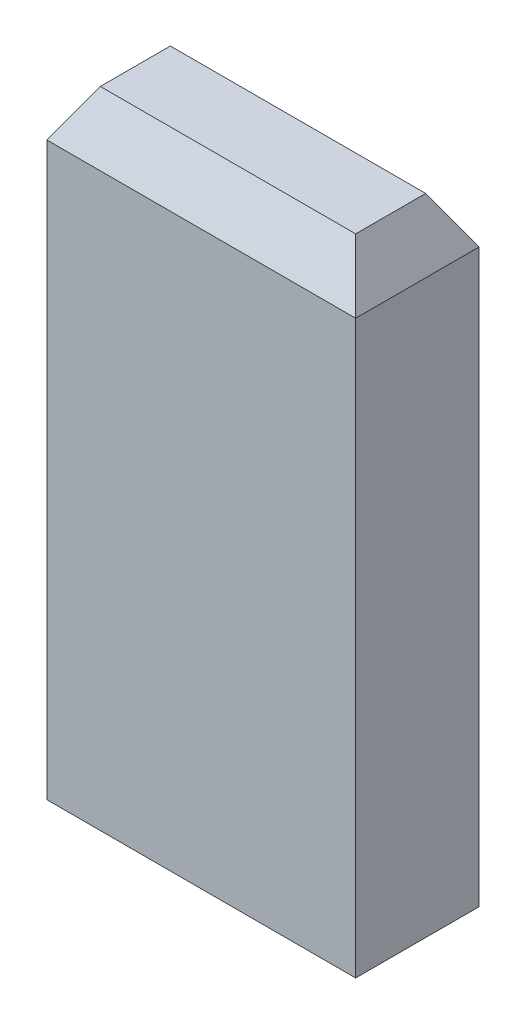
ISO-10303-21;
HEADER;
FILE_DESCRIPTION(('STEP AP214'),'2;1');
FILE_NAME('part.step','',(''),(''),'','','');
FILE_SCHEMA(('AUTOMOTIVE_DESIGN { 1 0 10303 214 1 1 1 1 }'));
ENDSEC;
DATA;
#1=APPLICATION_CONTEXT('core data for automotive mechanical design processes');
#2=APPLICATION_PROTOCOL_DEFINITION('international standard','automotive_design',2000,#1);
#3=PRODUCT_CONTEXT('',#1,'mechanical');
#4=PRODUCT('Part','Part','',(#3));
#5=PRODUCT_RELATED_PRODUCT_CATEGORY('part','',(#4));
#6=PRODUCT_DEFINITION_FORMATION('','',#4);
#7=PRODUCT_DEFINITION_CONTEXT('part definition',#1,'design');
#8=PRODUCT_DEFINITION('design','',#6,#7);
#9=PRODUCT_DEFINITION_SHAPE('','',#8);
#10=(LENGTH_UNIT() NAMED_UNIT(*) SI_UNIT(.MILLI.,.METRE.));
#11=(NAMED_UNIT(*) PLANE_ANGLE_UNIT() SI_UNIT($,.RADIAN.));
#12=(NAMED_UNIT(*) SI_UNIT($,.STERADIAN.) SOLID_ANGLE_UNIT());
#13=UNCERTAINTY_MEASURE_WITH_UNIT(LENGTH_MEASURE(1.E-05),#10,'distance_accuracy_value','');
#14=(GEOMETRIC_REPRESENTATION_CONTEXT(3) GLOBAL_UNCERTAINTY_ASSIGNED_CONTEXT((#13)) GLOBAL_UNIT_ASSIGNED_CONTEXT((#10,
#11,#12)) REPRESENTATION_CONTEXT('',''));
#15=CARTESIAN_POINT('',(0.,0.,0.));
#16=DIRECTION('',(0.,0.,1.));
#17=DIRECTION('',(1.,0.,0.));
#18=AXIS2_PLACEMENT_3D('',#15,#16,#17);
#19=CARTESIAN_POINT('',(0.,4.,0.));
#20=DIRECTION('',(-1.,0.,0.));
#21=DIRECTION('',(0.,0.,1.));
#22=AXIS2_PLACEMENT_3D('',#19,#20,#21);
#23=PLANE('',#22);
#24=DIRECTION('',(0.,-1.,0.));
#25=VECTOR('',#24,1.);
#26=CARTESIAN_POINT('',(0.,4.,-0.8));
#27=LINE('',#26,#25);
#28=CARTESIAN_POINT('',(0.,3.7,-0.8));
#29=VERTEX_POINT('',#28);
#30=CARTESIAN_POINT('',(0.,0.,-0.8));
#31=VERTEX_POINT('',#30);
#32=EDGE_CURVE('E88',#29,#31,#27,.T.);
#33=ORIENTED_EDGE('',*,*,#32,.F.);
#34=DIRECTION('',(0.,0.,1.));
#35=VECTOR('',#34,1.);
#36=CARTESIAN_POINT('',(0.,3.7,0.));
#37=LINE('',#36,#35);
#38=CARTESIAN_POINT('',(0.,3.7,0.));
#39=VERTEX_POINT('',#38);
#40=EDGE_CURVE('E11',#29,#39,#37,.T.);
#41=ORIENTED_EDGE('',*,*,#40,.T.);
#42=DIRECTION('',(0.,-1.,0.));
#43=VECTOR('',#42,1.);
#44=CARTESIAN_POINT('',(0.,4.,0.));
#45=LINE('',#44,#43);
#46=CARTESIAN_POINT('',(0.,0.,0.));
#47=VERTEX_POINT('',#46);
#48=EDGE_CURVE('E108',#39,#47,#45,.T.);
#49=ORIENTED_EDGE('',*,*,#48,.T.);
#50=DIRECTION('',(0.,0.,-1.));
#51=VECTOR('',#50,1.);
#52=CARTESIAN_POINT('',(0.,0.,0.));
#53=LINE('',#52,#51);
#54=EDGE_CURVE('E103',#47,#31,#53,.T.);
#55=ORIENTED_EDGE('',*,*,#54,.T.);
#56=EDGE_LOOP('',(#33,#41,#49,#55));
#57=FACE_BOUND('',#56,.T.);
#58=ADVANCED_FACE('F36',(#57),#23,.F.);
#59=CARTESIAN_POINT('',(0.,4.,-0.8));
#60=DIRECTION('',(0.,0.,1.));
#61=DIRECTION('',(1.,0.,0.));
#62=AXIS2_PLACEMENT_3D('',#59,#60,#61);
#63=PLANE('',#62);
#64=DIRECTION('',(0.,-1.,0.));
#65=VECTOR('',#64,1.);
#66=CARTESIAN_POINT('',(-2.,4.,-0.8));
#67=LINE('',#66,#65);
#68=CARTESIAN_POINT('',(-2.,3.7,-0.8));
#69=VERTEX_POINT('',#68);
#70=CARTESIAN_POINT('',(-2.,0.,-0.8));
#71=VERTEX_POINT('',#70);
#72=EDGE_CURVE('E97',#69,#71,#67,.T.);
#73=ORIENTED_EDGE('',*,*,#72,.F.);
#74=DIRECTION('',(1.,0.,0.));
#75=VECTOR('',#74,1.);
#76=CARTESIAN_POINT('',(0.,3.7,-0.8));
#77=LINE('',#76,#75);
#78=EDGE_CURVE('E45',#69,#29,#77,.T.);
#79=ORIENTED_EDGE('',*,*,#78,.T.);
#80=ORIENTED_EDGE('',*,*,#32,.T.);
#81=DIRECTION('',(-1.,0.,0.));
#82=VECTOR('',#81,1.);
#83=CARTESIAN_POINT('',(0.,0.,-0.8));
#84=LINE('',#83,#82);
#85=EDGE_CURVE('E91',#31,#71,#84,.T.);
#86=ORIENTED_EDGE('',*,*,#85,.T.);
#87=EDGE_LOOP('',(#73,#79,#80,#86));
#88=FACE_BOUND('',#87,.T.);
#89=ADVANCED_FACE('F90',(#88),#63,.F.);
#90=CARTESIAN_POINT('',(-2.,4.,0.));
#91=DIRECTION('',(1.,0.,0.));
#92=DIRECTION('',(0.,0.,-1.));
#93=AXIS2_PLACEMENT_3D('',#90,#91,#92);
#94=PLANE('',#93);
#95=DIRECTION('',(0.,-1.,0.));
#96=VECTOR('',#95,1.);
#97=CARTESIAN_POINT('',(-2.,4.,0.));
#98=LINE('',#97,#96);
#99=CARTESIAN_POINT('',(-2.,3.7,0.));
#100=VERTEX_POINT('',#99);
#101=CARTESIAN_POINT('',(-2.,0.,0.));
#102=VERTEX_POINT('',#101);
#103=EDGE_CURVE('E118',#100,#102,#98,.T.);
#104=ORIENTED_EDGE('',*,*,#103,.F.);
#105=DIRECTION('',(0.,0.,-1.));
#106=VECTOR('',#105,1.);
#107=CARTESIAN_POINT('',(-2.,3.7,-0.8));
#108=LINE('',#107,#106);
#109=EDGE_CURVE('E60',#100,#69,#108,.T.);
#110=ORIENTED_EDGE('',*,*,#109,.T.);
#111=ORIENTED_EDGE('',*,*,#72,.T.);
#112=DIRECTION('',(0.,0.,1.));
#113=VECTOR('',#112,1.);
#114=CARTESIAN_POINT('',(-2.,0.,0.));
#115=LINE('',#114,#113);
#116=EDGE_CURVE('E105',#71,#102,#115,.T.);
#117=ORIENTED_EDGE('',*,*,#116,.T.);
#118=EDGE_LOOP('',(#104,#110,#111,#117));
#119=FACE_BOUND('',#118,.T.);
#120=ADVANCED_FACE('F156',(#119),#94,.F.);
#121=CARTESIAN_POINT('',(0.,4.,0.));
#122=DIRECTION('',(0.,0.,-1.));
#123=DIRECTION('',(-1.,0.,0.));
#124=AXIS2_PLACEMENT_3D('',#121,#122,#123);
#125=PLANE('',#124);
#126=ORIENTED_EDGE('',*,*,#48,.F.);
#127=DIRECTION('',(-1.,0.,0.));
#128=VECTOR('',#127,1.);
#129=CARTESIAN_POINT('',(-2.,3.7,0.));
#130=LINE('',#129,#128);
#131=EDGE_CURVE('E129',#39,#100,#130,.T.);
#132=ORIENTED_EDGE('',*,*,#131,.T.);
#133=ORIENTED_EDGE('',*,*,#103,.T.);
#134=DIRECTION('',(1.,0.,0.));
#135=VECTOR('',#134,1.);
#136=CARTESIAN_POINT('',(0.,0.,0.));
#137=LINE('',#136,#135);
#138=EDGE_CURVE('E115',#102,#47,#137,.T.);
#139=ORIENTED_EDGE('',*,*,#138,.T.);
#140=EDGE_LOOP('',(#126,#132,#133,#139));
#141=FACE_BOUND('',#140,.T.);
#142=ADVANCED_FACE('F155',(#141),#125,.F.);
#143=CARTESIAN_POINT('',(0.,4.,0.));
#144=DIRECTION('',(0.,1.,0.));
#145=DIRECTION('',(0.,0.,1.));
#146=AXIS2_PLACEMENT_3D('',#143,#144,#145);
#147=PLANE('',#146);
#148=DIRECTION('',(0.,0.,1.));
#149=VECTOR('',#148,1.);
#150=CARTESIAN_POINT('',(-1.82679491924311,4.,0.));
#151=LINE('',#150,#149);
#152=CARTESIAN_POINT('',(-1.82679491924311,4.,-0.626794919243112));
#153=VERTEX_POINT('',#152);
#154=CARTESIAN_POINT('',(-1.82679491924311,4.,-0.173205080756888));
#155=VERTEX_POINT('',#154);
#156=EDGE_CURVE('E124',#153,#155,#151,.T.);
#157=ORIENTED_EDGE('',*,*,#156,.T.);
#158=DIRECTION('',(1.,0.,0.));
#159=VECTOR('',#158,1.);
#160=CARTESIAN_POINT('',(0.,4.,-0.173205080756888));
#161=LINE('',#160,#159);
#162=CARTESIAN_POINT('',(-0.173205080756888,4.,-0.173205080756888));
#163=VERTEX_POINT('',#162);
#164=EDGE_CURVE('E126',#155,#163,#161,.T.);
#165=ORIENTED_EDGE('',*,*,#164,.T.);
#166=DIRECTION('',(0.,0.,-1.));
#167=VECTOR('',#166,1.);
#168=CARTESIAN_POINT('',(-0.173205080756888,4.,-0.8));
#169=LINE('',#168,#167);
#170=CARTESIAN_POINT('',(-0.173205080756888,4.,-0.626794919243112));
#171=VERTEX_POINT('',#170);
#172=EDGE_CURVE('E96',#163,#171,#169,.T.);
#173=ORIENTED_EDGE('',*,*,#172,.T.);
#174=DIRECTION('',(-1.,0.,0.));
#175=VECTOR('',#174,1.);
#176=CARTESIAN_POINT('',(-2.,4.,-0.626794919243112));
#177=LINE('',#176,#175);
#178=EDGE_CURVE('E122',#171,#153,#177,.T.);
#179=ORIENTED_EDGE('',*,*,#178,.T.);
#180=EDGE_LOOP('',(#157,#165,#173,#179));
#181=FACE_BOUND('',#180,.T.);
#182=ADVANCED_FACE('F148',(#181),#147,.T.);
#183=CARTESIAN_POINT('',(0.,0.,0.));
#184=DIRECTION('',(0.,1.,0.));
#185=DIRECTION('',(0.,0.,1.));
#186=AXIS2_PLACEMENT_3D('',#183,#184,#185);
#187=PLANE('',#186);
#188=ORIENTED_EDGE('',*,*,#54,.F.);
#189=ORIENTED_EDGE('',*,*,#138,.F.);
#190=ORIENTED_EDGE('',*,*,#116,.F.);
#191=ORIENTED_EDGE('',*,*,#85,.F.);
#192=EDGE_LOOP('',(#188,#189,#190,#191));
#193=FACE_BOUND('',#192,.T.);
#194=ADVANCED_FACE('F101',(#193),#187,.F.);
#195=CARTESIAN_POINT('',(0.,4.,-0.626794919243112));
#196=DIRECTION('',(0.,0.499999999999998,-0.86602540378444));
#197=DIRECTION('',(1.,0.,0.));
#198=AXIS2_PLACEMENT_3D('',#195,#196,#197);
#199=PLANE('',#198);
#200=DIRECTION('',(-0.447213595499956,0.774596669241485,0.447213595499956));
#201=VECTOR('',#200,1.);
#202=CARTESIAN_POINT('',(-0.298564064605509,4.21712812921102,-0.501435935394491));
#203=LINE('',#202,#201);
#204=EDGE_CURVE('E112',#29,#171,#203,.T.);
#205=ORIENTED_EDGE('',*,*,#204,.F.);
#206=ORIENTED_EDGE('',*,*,#78,.F.);
#207=DIRECTION('',(0.447213595499956,0.774596669241485,0.447213595499956));
#208=VECTOR('',#207,1.);
#209=CARTESIAN_POINT('',(-1.46143593539449,4.63282032302755,-0.261435935394492));
#210=LINE('',#209,#208);
#211=EDGE_CURVE('E40',#153,#69,#210,.F.);
#212=ORIENTED_EDGE('',*,*,#211,.F.);
#213=ORIENTED_EDGE('',*,*,#178,.F.);
#214=EDGE_LOOP('',(#205,#206,#212,#213));
#215=FACE_BOUND('',#214,.T.);
#216=ADVANCED_FACE('F38',(#215),#199,.T.);
#217=CARTESIAN_POINT('',(-1.82679491924311,4.,0.));
#218=DIRECTION('',(-0.86602540378444,0.499999999999998,0.));
#219=DIRECTION('',(0.,0.,-1.));
#220=AXIS2_PLACEMENT_3D('',#217,#218,#219);
#221=PLANE('',#220);
#222=ORIENTED_EDGE('',*,*,#211,.T.);
#223=ORIENTED_EDGE('',*,*,#109,.F.);
#224=DIRECTION('',(0.447213595499956,0.774596669241485,-0.447213595499956));
#225=VECTOR('',#224,1.);
#226=CARTESIAN_POINT('',(-1.86143593539449,3.94,-0.13856406460551));
#227=LINE('',#226,#225);
#228=EDGE_CURVE('E136',#155,#100,#227,.F.);
#229=ORIENTED_EDGE('',*,*,#228,.F.);
#230=ORIENTED_EDGE('',*,*,#156,.F.);
#231=EDGE_LOOP('',(#222,#223,#229,#230));
#232=FACE_BOUND('',#231,.T.);
#233=ADVANCED_FACE('F173',(#232),#221,.T.);
#234=CARTESIAN_POINT('',(-0.173205080756888,4.,0.));
#235=DIRECTION('',(0.86602540378444,0.499999999999998,0.));
#236=DIRECTION('',(0.,0.,1.));
#237=AXIS2_PLACEMENT_3D('',#234,#235,#236);
#238=PLANE('',#237);
#239=ORIENTED_EDGE('',*,*,#204,.T.);
#240=ORIENTED_EDGE('',*,*,#172,.F.);
#241=DIRECTION('',(0.447213595499956,-0.774596669241485,0.447213595499956));
#242=VECTOR('',#241,1.);
#243=CARTESIAN_POINT('',(-0.13856406460551,3.94,-0.13856406460551));
#244=LINE('',#243,#242);
#245=EDGE_CURVE('E134',#39,#163,#244,.F.);
#246=ORIENTED_EDGE('',*,*,#245,.F.);
#247=ORIENTED_EDGE('',*,*,#40,.F.);
#248=EDGE_LOOP('',(#239,#240,#246,#247));
#249=FACE_BOUND('',#248,.T.);
#250=ADVANCED_FACE('F141',(#249),#238,.T.);
#251=CARTESIAN_POINT('',(0.,4.,-0.173205080756888));
#252=DIRECTION('',(0.,0.499999999999998,0.86602540378444));
#253=DIRECTION('',(-1.,0.,0.));
#254=AXIS2_PLACEMENT_3D('',#251,#252,#253);
#255=PLANE('',#254);
#256=ORIENTED_EDGE('',*,*,#228,.T.);
#257=ORIENTED_EDGE('',*,*,#131,.F.);
#258=ORIENTED_EDGE('',*,*,#245,.T.);
#259=ORIENTED_EDGE('',*,*,#164,.F.);
#260=EDGE_LOOP('',(#256,#257,#258,#259));
#261=FACE_BOUND('',#260,.T.);
#262=ADVANCED_FACE('F152',(#261),#255,.T.);
#263=CLOSED_SHELL('',(#58,#89,#120,#142,#182,#194,#216,#233,#250,#262));
#264=MANIFOLD_SOLID_BREP('B2',#263);
#265=ADVANCED_BREP_SHAPE_REPRESENTATION('',(#18,#264),#14);
#266=SHAPE_DEFINITION_REPRESENTATION(#9,#265);
ENDSEC;
END-ISO-10303-21;
